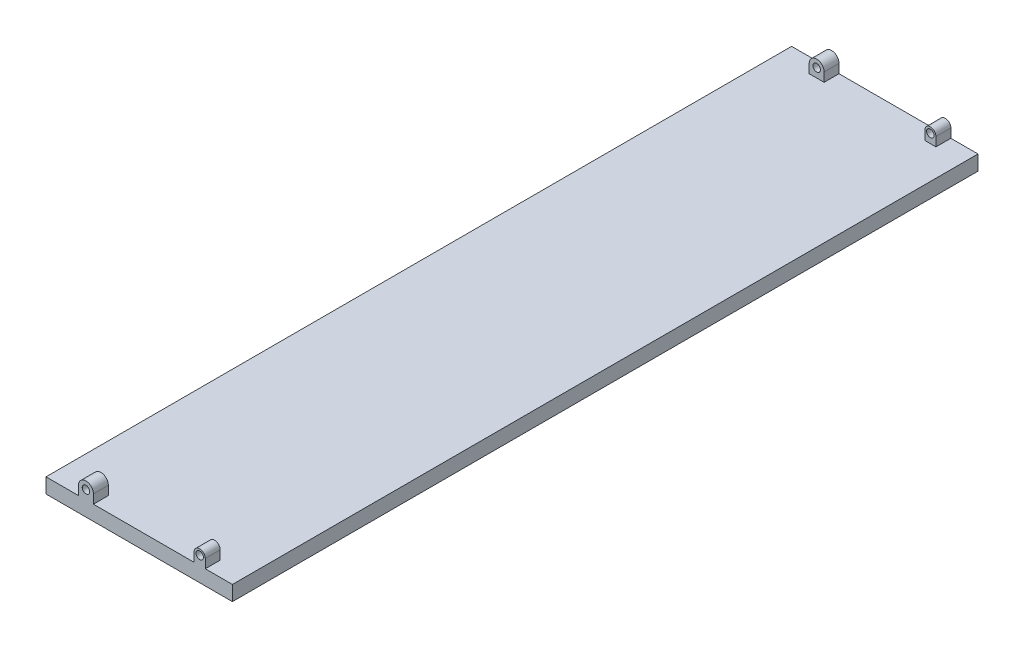
ISO-10303-21;
HEADER;
FILE_DESCRIPTION(('STEP AP214'),'2;1');
FILE_NAME('part.step','',(''),(''),'','','');
FILE_SCHEMA(('AUTOMOTIVE_DESIGN { 1 0 10303 214 1 1 1 1 }'));
ENDSEC;
DATA;
#1=APPLICATION_CONTEXT('core data for automotive mechanical design processes');
#2=APPLICATION_PROTOCOL_DEFINITION('international standard','automotive_design',2000,#1);
#3=PRODUCT_CONTEXT('',#1,'mechanical');
#4=PRODUCT('Part','Part','',(#3));
#5=PRODUCT_RELATED_PRODUCT_CATEGORY('part','',(#4));
#6=PRODUCT_DEFINITION_FORMATION('','',#4);
#7=PRODUCT_DEFINITION_CONTEXT('part definition',#1,'design');
#8=PRODUCT_DEFINITION('design','',#6,#7);
#9=PRODUCT_DEFINITION_SHAPE('','',#8);
#10=(LENGTH_UNIT() NAMED_UNIT(*) SI_UNIT(.MILLI.,.METRE.));
#11=(NAMED_UNIT(*) PLANE_ANGLE_UNIT() SI_UNIT($,.RADIAN.));
#12=(NAMED_UNIT(*) SI_UNIT($,.STERADIAN.) SOLID_ANGLE_UNIT());
#13=UNCERTAINTY_MEASURE_WITH_UNIT(LENGTH_MEASURE(1.E-05),#10,'distance_accuracy_value','');
#14=(GEOMETRIC_REPRESENTATION_CONTEXT(3) GLOBAL_UNCERTAINTY_ASSIGNED_CONTEXT((#13)) GLOBAL_UNIT_ASSIGNED_CONTEXT((#10,
#11,#12)) REPRESENTATION_CONTEXT('',''));
#15=CARTESIAN_POINT('',(0.,0.,0.));
#16=DIRECTION('',(0.,0.,1.));
#17=DIRECTION('',(1.,0.,0.));
#18=AXIS2_PLACEMENT_3D('',#15,#16,#17);
#19=CARTESIAN_POINT('',(-125.,10.,-1000.));
#20=DIRECTION('',(0.,1.,0.));
#21=DIRECTION('',(0.,0.,1.));
#22=AXIS2_PLACEMENT_3D('',#19,#20,#21);
#23=PLANE('',#22);
#24=DIRECTION('',(-1.,0.,0.));
#25=VECTOR('',#24,1.);
#26=CARTESIAN_POINT('',(-125.,10.,-1000.));
#27=LINE('',#26,#25);
#28=CARTESIAN_POINT('',(73.5999999999999,10.,-1000.));
#29=VERTEX_POINT('',#28);
#30=CARTESIAN_POINT('',(-61.4000000000001,10.,-1000.));
#31=VERTEX_POINT('',#30);
#32=EDGE_CURVE('E318',#29,#31,#27,.T.);
#33=ORIENTED_EDGE('',*,*,#32,.T.);
#34=DIRECTION('',(0.,0.,-1.));
#35=VECTOR('',#34,1.);
#36=CARTESIAN_POINT('',(-61.4000000000001,10.,-980.));
#37=LINE('',#36,#35);
#38=CARTESIAN_POINT('',(-61.4000000000001,10.,-980.));
#39=VERTEX_POINT('',#38);
#40=EDGE_CURVE('E50',#39,#31,#37,.T.);
#41=ORIENTED_EDGE('',*,*,#40,.F.);
#42=DIRECTION('',(1.,0.,0.));
#43=VECTOR('',#42,1.);
#44=CARTESIAN_POINT('',(-61.4000000000001,10.,-980.));
#45=LINE('',#44,#43);
#46=CARTESIAN_POINT('',(-81.4000000000001,10.,-980.));
#47=VERTEX_POINT('',#46);
#48=EDGE_CURVE('E55',#47,#39,#45,.T.);
#49=ORIENTED_EDGE('',*,*,#48,.F.);
#50=DIRECTION('',(0.,0.,-1.));
#51=VECTOR('',#50,1.);
#52=CARTESIAN_POINT('',(-81.4000000000001,10.,-980.));
#53=LINE('',#52,#51);
#54=CARTESIAN_POINT('',(-81.4000000000001,10.,-1000.));
#55=VERTEX_POINT('',#54);
#56=EDGE_CURVE('E190',#47,#55,#53,.T.);
#57=ORIENTED_EDGE('',*,*,#56,.T.);
#58=CARTESIAN_POINT('',(-125.,10.,-1000.));
#59=VERTEX_POINT('',#58);
#60=EDGE_CURVE('E313',#55,#59,#27,.T.);
#61=ORIENTED_EDGE('',*,*,#60,.T.);
#62=DIRECTION('',(0.,0.,1.));
#63=VECTOR('',#62,1.);
#64=CARTESIAN_POINT('',(-125.,10.,-1000.));
#65=LINE('',#64,#63);
#66=CARTESIAN_POINT('',(-125.,10.,0.));
#67=VERTEX_POINT('',#66);
#68=EDGE_CURVE('E338',#59,#67,#65,.T.);
#69=ORIENTED_EDGE('',*,*,#68,.T.);
#70=DIRECTION('',(-1.,0.,0.));
#71=VECTOR('',#70,1.);
#72=CARTESIAN_POINT('',(-125.,10.,0.));
#73=LINE('',#72,#71);
#74=CARTESIAN_POINT('',(-81.4000000000001,10.,0.));
#75=VERTEX_POINT('',#74);
#76=EDGE_CURVE('E327',#75,#67,#73,.T.);
#77=ORIENTED_EDGE('',*,*,#76,.F.);
#78=DIRECTION('',(0.,0.,1.));
#79=VECTOR('',#78,1.);
#80=CARTESIAN_POINT('',(-81.4000000000001,10.,-20.));
#81=LINE('',#80,#79);
#82=CARTESIAN_POINT('',(-81.4000000000001,10.,-20.));
#83=VERTEX_POINT('',#82);
#84=EDGE_CURVE('E270',#83,#75,#81,.T.);
#85=ORIENTED_EDGE('',*,*,#84,.F.);
#86=DIRECTION('',(1.,0.,0.));
#87=VECTOR('',#86,1.);
#88=CARTESIAN_POINT('',(-61.4000000000001,10.,-20.));
#89=LINE('',#88,#87);
#90=CARTESIAN_POINT('',(-61.4000000000001,10.,-20.));
#91=VERTEX_POINT('',#90);
#92=EDGE_CURVE('E249',#83,#91,#89,.T.);
#93=ORIENTED_EDGE('',*,*,#92,.T.);
#94=DIRECTION('',(0.,0.,1.));
#95=VECTOR('',#94,1.);
#96=CARTESIAN_POINT('',(-61.4000000000001,10.,-20.));
#97=LINE('',#96,#95);
#98=CARTESIAN_POINT('',(-61.4000000000001,10.,0.));
#99=VERTEX_POINT('',#98);
#100=EDGE_CURVE('E262',#91,#99,#97,.T.);
#101=ORIENTED_EDGE('',*,*,#100,.T.);
#102=CARTESIAN_POINT('',(73.5999999999999,10.,0.));
#103=VERTEX_POINT('',#102);
#104=EDGE_CURVE('E332',#103,#99,#73,.T.);
#105=ORIENTED_EDGE('',*,*,#104,.F.);
#106=DIRECTION('',(0.,0.,1.));
#107=VECTOR('',#106,1.);
#108=CARTESIAN_POINT('',(73.5999999999999,10.,-20.));
#109=LINE('',#108,#107);
#110=CARTESIAN_POINT('',(73.5999999999999,10.,-20.));
#111=VERTEX_POINT('',#110);
#112=EDGE_CURVE('E301',#111,#103,#109,.T.);
#113=ORIENTED_EDGE('',*,*,#112,.F.);
#114=DIRECTION('',(1.,0.,0.));
#115=VECTOR('',#114,1.);
#116=CARTESIAN_POINT('',(73.5999999999999,10.,-20.));
#117=LINE('',#116,#115);
#118=CARTESIAN_POINT('',(88.5999999999999,10.,-20.));
#119=VERTEX_POINT('',#118);
#120=EDGE_CURVE('E280',#111,#119,#117,.T.);
#121=ORIENTED_EDGE('',*,*,#120,.T.);
#122=DIRECTION('',(0.,0.,1.));
#123=VECTOR('',#122,1.);
#124=CARTESIAN_POINT('',(88.5999999999999,10.,-20.));
#125=LINE('',#124,#123);
#126=CARTESIAN_POINT('',(88.5999999999999,10.,0.));
#127=VERTEX_POINT('',#126);
#128=EDGE_CURVE('E293',#119,#127,#125,.T.);
#129=ORIENTED_EDGE('',*,*,#128,.T.);
#130=CARTESIAN_POINT('',(125.,10.,0.));
#131=VERTEX_POINT('',#130);
#132=EDGE_CURVE('E328',#131,#127,#73,.T.);
#133=ORIENTED_EDGE('',*,*,#132,.F.);
#134=DIRECTION('',(0.,0.,1.));
#135=VECTOR('',#134,1.);
#136=CARTESIAN_POINT('',(125.,10.,-1000.));
#137=LINE('',#136,#135);
#138=CARTESIAN_POINT('',(125.,10.,-1000.));
#139=VERTEX_POINT('',#138);
#140=EDGE_CURVE('E324',#139,#131,#137,.T.);
#141=ORIENTED_EDGE('',*,*,#140,.F.);
#142=CARTESIAN_POINT('',(88.5999999999999,10.,-1000.));
#143=VERTEX_POINT('',#142);
#144=EDGE_CURVE('E315',#139,#143,#27,.T.);
#145=ORIENTED_EDGE('',*,*,#144,.T.);
#146=DIRECTION('',(0.,0.,-1.));
#147=VECTOR('',#146,1.);
#148=CARTESIAN_POINT('',(88.5999999999999,10.,-980.));
#149=LINE('',#148,#147);
#150=CARTESIAN_POINT('',(88.5999999999999,10.,-980.));
#151=VERTEX_POINT('',#150);
#152=EDGE_CURVE('E224',#151,#143,#149,.T.);
#153=ORIENTED_EDGE('',*,*,#152,.F.);
#154=DIRECTION('',(1.,0.,0.));
#155=VECTOR('',#154,1.);
#156=CARTESIAN_POINT('',(73.5999999999999,10.,-980.));
#157=LINE('',#156,#155);
#158=CARTESIAN_POINT('',(73.5999999999999,10.,-980.));
#159=VERTEX_POINT('',#158);
#160=EDGE_CURVE('E207',#159,#151,#157,.T.);
#161=ORIENTED_EDGE('',*,*,#160,.F.);
#162=DIRECTION('',(0.,0.,-1.));
#163=VECTOR('',#162,1.);
#164=CARTESIAN_POINT('',(73.5999999999999,10.,-980.));
#165=LINE('',#164,#163);
#166=EDGE_CURVE('E218',#159,#29,#165,.T.);
#167=ORIENTED_EDGE('',*,*,#166,.T.);
#168=EDGE_LOOP('',(#33,#41,#49,#57,#61,#69,#77,#85,#93,#101,#105,#113,#121,#129,#133,#141,#145,
#153,#161,#167));
#169=FACE_BOUND('',#168,.T.);
#170=ADVANCED_FACE('F33',(#169),#23,.T.);
#171=CARTESIAN_POINT('',(125.,-10.,-1000.));
#172=DIRECTION('',(1.,0.,0.));
#173=DIRECTION('',(0.,0.,-1.));
#174=AXIS2_PLACEMENT_3D('',#171,#172,#173);
#175=PLANE('',#174);
#176=DIRECTION('',(0.,1.,0.));
#177=VECTOR('',#176,1.);
#178=CARTESIAN_POINT('',(125.,-10.,0.));
#179=LINE('',#178,#177);
#180=CARTESIAN_POINT('',(125.,-10.,0.));
#181=VERTEX_POINT('',#180);
#182=EDGE_CURVE('E303',#181,#131,#179,.T.);
#183=ORIENTED_EDGE('',*,*,#182,.F.);
#184=DIRECTION('',(0.,0.,1.));
#185=VECTOR('',#184,1.);
#186=CARTESIAN_POINT('',(125.,-10.,-1000.));
#187=LINE('',#186,#185);
#188=CARTESIAN_POINT('',(125.,-10.,-1000.));
#189=VERTEX_POINT('',#188);
#190=EDGE_CURVE('E11',#189,#181,#187,.T.);
#191=ORIENTED_EDGE('',*,*,#190,.F.);
#192=DIRECTION('',(0.,1.,0.));
#193=VECTOR('',#192,1.);
#194=CARTESIAN_POINT('',(125.,-10.,-1000.));
#195=LINE('',#194,#193);
#196=EDGE_CURVE('E310',#189,#139,#195,.T.);
#197=ORIENTED_EDGE('',*,*,#196,.T.);
#198=ORIENTED_EDGE('',*,*,#140,.T.);
#199=EDGE_LOOP('',(#183,#191,#197,#198));
#200=FACE_BOUND('',#199,.T.);
#201=ADVANCED_FACE('F35',(#200),#175,.T.);
#202=CARTESIAN_POINT('',(-125.,-10.,-1000.));
#203=DIRECTION('',(0.,-1.,0.));
#204=DIRECTION('',(0.,0.,-1.));
#205=AXIS2_PLACEMENT_3D('',#202,#203,#204);
#206=PLANE('',#205);
#207=DIRECTION('',(1.,0.,0.));
#208=VECTOR('',#207,1.);
#209=CARTESIAN_POINT('',(-125.,-10.,0.));
#210=LINE('',#209,#208);
#211=CARTESIAN_POINT('',(-125.,-10.,0.));
#212=VERTEX_POINT('',#211);
#213=EDGE_CURVE('E314',#212,#181,#210,.T.);
#214=ORIENTED_EDGE('',*,*,#213,.F.);
#215=DIRECTION('',(0.,0.,1.));
#216=VECTOR('',#215,1.);
#217=CARTESIAN_POINT('',(-125.,-10.,-1000.));
#218=LINE('',#217,#216);
#219=CARTESIAN_POINT('',(-125.,-10.,-1000.));
#220=VERTEX_POINT('',#219);
#221=EDGE_CURVE('E42',#220,#212,#218,.T.);
#222=ORIENTED_EDGE('',*,*,#221,.F.);
#223=DIRECTION('',(1.,0.,0.));
#224=VECTOR('',#223,1.);
#225=CARTESIAN_POINT('',(-125.,-10.,-1000.));
#226=LINE('',#225,#224);
#227=EDGE_CURVE('E321',#220,#189,#226,.T.);
#228=ORIENTED_EDGE('',*,*,#227,.T.);
#229=ORIENTED_EDGE('',*,*,#190,.T.);
#230=EDGE_LOOP('',(#214,#222,#228,#229));
#231=FACE_BOUND('',#230,.T.);
#232=ADVANCED_FACE('F388',(#231),#206,.T.);
#233=CARTESIAN_POINT('',(-125.,-10.,-1000.));
#234=DIRECTION('',(-1.,0.,0.));
#235=DIRECTION('',(0.,0.,1.));
#236=AXIS2_PLACEMENT_3D('',#233,#234,#235);
#237=PLANE('',#236);
#238=DIRECTION('',(0.,-1.,0.));
#239=VECTOR('',#238,1.);
#240=CARTESIAN_POINT('',(-125.,-10.,0.));
#241=LINE('',#240,#239);
#242=EDGE_CURVE('E331',#67,#212,#241,.T.);
#243=ORIENTED_EDGE('',*,*,#242,.F.);
#244=ORIENTED_EDGE('',*,*,#68,.F.);
#245=DIRECTION('',(0.,-1.,0.));
#246=VECTOR('',#245,1.);
#247=CARTESIAN_POINT('',(-125.,-10.,-1000.));
#248=LINE('',#247,#246);
#249=EDGE_CURVE('E317',#59,#220,#248,.T.);
#250=ORIENTED_EDGE('',*,*,#249,.T.);
#251=ORIENTED_EDGE('',*,*,#221,.T.);
#252=EDGE_LOOP('',(#243,#244,#250,#251));
#253=FACE_BOUND('',#252,.T.);
#254=ADVANCED_FACE('F391',(#253),#237,.T.);
#255=CARTESIAN_POINT('',(0.,0.,-1000.));
#256=DIRECTION('',(0.,0.,-1.));
#257=DIRECTION('',(-1.,0.,0.));
#258=AXIS2_PLACEMENT_3D('',#255,#256,#257);
#259=PLANE('',#258);
#260=CARTESIAN_POINT('',(-71.4000000000001,22.,-1000.));
#261=DIRECTION('',(0.,0.,-1.));
#262=DIRECTION('',(-1.,0.,0.));
#263=AXIS2_PLACEMENT_3D('',#260,#261,#262);
#264=CIRCLE('',#263,5.025);
#265=CARTESIAN_POINT('',(-76.4250000000001,22.,-1000.));
#266=VERTEX_POINT('',#265);
#267=EDGE_CURVE('E600',#266,#266,#264,.T.);
#268=ORIENTED_EDGE('',*,*,#267,.F.);
#269=EDGE_LOOP('',(#268));
#270=FACE_BOUND('',#269,.T.);
#271=CARTESIAN_POINT('',(81.0999999999999,22.,-1000.));
#272=DIRECTION('',(0.,0.,-1.));
#273=DIRECTION('',(-1.,0.,0.));
#274=AXIS2_PLACEMENT_3D('',#271,#272,#273);
#275=CIRCLE('',#274,5.025);
#276=CARTESIAN_POINT('',(76.0749999999999,22.,-1000.));
#277=VERTEX_POINT('',#276);
#278=EDGE_CURVE('E607',#277,#277,#275,.T.);
#279=ORIENTED_EDGE('',*,*,#278,.F.);
#280=EDGE_LOOP('',(#279));
#281=FACE_BOUND('',#280,.T.);
#282=ORIENTED_EDGE('',*,*,#196,.F.);
#283=ORIENTED_EDGE('',*,*,#227,.F.);
#284=ORIENTED_EDGE('',*,*,#249,.F.);
#285=ORIENTED_EDGE('',*,*,#60,.F.);
#286=DIRECTION('',(0.,-1.,0.));
#287=VECTOR('',#286,1.);
#288=CARTESIAN_POINT('',(-81.4000000000001,10.,-1000.));
#289=LINE('',#288,#287);
#290=CARTESIAN_POINT('',(-81.4000000000001,22.,-1000.));
#291=VERTEX_POINT('',#290);
#292=EDGE_CURVE('E199',#291,#55,#289,.T.);
#293=ORIENTED_EDGE('',*,*,#292,.F.);
#294=CARTESIAN_POINT('',(-71.4000000000001,22.,-1000.));
#295=DIRECTION('',(0.,0.,1.));
#296=DIRECTION('',(-1.,0.,0.));
#297=AXIS2_PLACEMENT_3D('',#294,#295,#296);
#298=CIRCLE('',#297,10.);
#299=CARTESIAN_POINT('',(-61.4000000000001,22.,-1000.));
#300=VERTEX_POINT('',#299);
#301=EDGE_CURVE('E185',#300,#291,#298,.T.);
#302=ORIENTED_EDGE('',*,*,#301,.F.);
#303=DIRECTION('',(0.,1.,0.));
#304=VECTOR('',#303,1.);
#305=CARTESIAN_POINT('',(-61.4000000000001,22.,-1000.));
#306=LINE('',#305,#304);
#307=EDGE_CURVE('E194',#31,#300,#306,.T.);
#308=ORIENTED_EDGE('',*,*,#307,.F.);
#309=ORIENTED_EDGE('',*,*,#32,.F.);
#310=DIRECTION('',(0.,-1.,0.));
#311=VECTOR('',#310,1.);
#312=CARTESIAN_POINT('',(73.5999999999999,22.,-1000.));
#313=LINE('',#312,#311);
#314=CARTESIAN_POINT('',(73.5999999999999,22.,-1000.));
#315=VERTEX_POINT('',#314);
#316=EDGE_CURVE('E204',#315,#29,#313,.T.);
#317=ORIENTED_EDGE('',*,*,#316,.F.);
#318=CARTESIAN_POINT('',(81.0999999999999,22.,-1000.));
#319=DIRECTION('',(0.,0.,1.));
#320=DIRECTION('',(1.,0.,0.));
#321=AXIS2_PLACEMENT_3D('',#318,#319,#320);
#322=CIRCLE('',#321,7.5);
#323=CARTESIAN_POINT('',(88.5999999999999,22.,-1000.));
#324=VERTEX_POINT('',#323);
#325=EDGE_CURVE('E221',#324,#315,#322,.T.);
#326=ORIENTED_EDGE('',*,*,#325,.F.);
#327=DIRECTION('',(0.,1.,0.));
#328=VECTOR('',#327,1.);
#329=CARTESIAN_POINT('',(88.5999999999999,10.,-1000.));
#330=LINE('',#329,#328);
#331=EDGE_CURVE('E211',#143,#324,#330,.T.);
#332=ORIENTED_EDGE('',*,*,#331,.F.);
#333=ORIENTED_EDGE('',*,*,#144,.F.);
#334=EDGE_LOOP('',(#282,#283,#284,#285,#293,#302,#308,#309,#317,#326,#332,#333));
#335=FACE_BOUND('',#334,.T.);
#336=ADVANCED_FACE('F394',(#270,#281,#335),#259,.T.);
#337=CARTESIAN_POINT('',(0.,0.,0.));
#338=DIRECTION('',(0.,0.,-1.));
#339=DIRECTION('',(-1.,0.,0.));
#340=AXIS2_PLACEMENT_3D('',#337,#338,#339);
#341=PLANE('',#340);
#342=CARTESIAN_POINT('',(-71.4000000000001,22.,0.));
#343=DIRECTION('',(0.,0.,1.));
#344=DIRECTION('',(1.,0.,0.));
#345=AXIS2_PLACEMENT_3D('',#342,#343,#344);
#346=CIRCLE('',#345,5.025);
#347=CARTESIAN_POINT('',(-66.3750000000001,22.,0.));
#348=VERTEX_POINT('',#347);
#349=EDGE_CURVE('E227',#348,#348,#346,.T.);
#350=ORIENTED_EDGE('',*,*,#349,.F.);
#351=EDGE_LOOP('',(#350));
#352=FACE_BOUND('',#351,.T.);
#353=CARTESIAN_POINT('',(81.0999999999999,22.,0.));
#354=DIRECTION('',(0.,0.,1.));
#355=DIRECTION('',(1.,0.,0.));
#356=AXIS2_PLACEMENT_3D('',#353,#354,#355);
#357=CIRCLE('',#356,5.025);
#358=CARTESIAN_POINT('',(86.1249999999999,22.,0.));
#359=VERTEX_POINT('',#358);
#360=EDGE_CURVE('E242',#359,#359,#357,.T.);
#361=ORIENTED_EDGE('',*,*,#360,.F.);
#362=EDGE_LOOP('',(#361));
#363=FACE_BOUND('',#362,.T.);
#364=ORIENTED_EDGE('',*,*,#182,.T.);
#365=ORIENTED_EDGE('',*,*,#132,.T.);
#366=DIRECTION('',(0.,1.,0.));
#367=VECTOR('',#366,1.);
#368=CARTESIAN_POINT('',(88.5999999999999,10.,0.));
#369=LINE('',#368,#367);
#370=CARTESIAN_POINT('',(88.5999999999999,22.,0.));
#371=VERTEX_POINT('',#370);
#372=EDGE_CURVE('E273',#127,#371,#369,.T.);
#373=ORIENTED_EDGE('',*,*,#372,.T.);
#374=CARTESIAN_POINT('',(81.0999999999999,22.,0.));
#375=DIRECTION('',(0.,0.,1.));
#376=DIRECTION('',(1.,0.,0.));
#377=AXIS2_PLACEMENT_3D('',#374,#375,#376);
#378=CIRCLE('',#377,7.5);
#379=CARTESIAN_POINT('',(73.5999999999999,22.,0.));
#380=VERTEX_POINT('',#379);
#381=EDGE_CURVE('E296',#371,#380,#378,.T.);
#382=ORIENTED_EDGE('',*,*,#381,.T.);
#383=DIRECTION('',(0.,-1.,0.));
#384=VECTOR('',#383,1.);
#385=CARTESIAN_POINT('',(73.5999999999999,22.,0.));
#386=LINE('',#385,#384);
#387=EDGE_CURVE('E284',#380,#103,#386,.T.);
#388=ORIENTED_EDGE('',*,*,#387,.T.);
#389=ORIENTED_EDGE('',*,*,#104,.T.);
#390=DIRECTION('',(0.,1.,0.));
#391=VECTOR('',#390,1.);
#392=CARTESIAN_POINT('',(-61.4000000000001,22.,0.));
#393=LINE('',#392,#391);
#394=CARTESIAN_POINT('',(-61.4000000000001,22.,0.));
#395=VERTEX_POINT('',#394);
#396=EDGE_CURVE('E263',#99,#395,#393,.T.);
#397=ORIENTED_EDGE('',*,*,#396,.T.);
#398=CARTESIAN_POINT('',(-71.4000000000001,22.,0.));
#399=DIRECTION('',(0.,0.,1.));
#400=DIRECTION('',(-1.,0.,0.));
#401=AXIS2_PLACEMENT_3D('',#398,#399,#400);
#402=CIRCLE('',#401,10.);
#403=CARTESIAN_POINT('',(-81.4000000000001,22.,0.));
#404=VERTEX_POINT('',#403);
#405=EDGE_CURVE('E266',#395,#404,#402,.T.);
#406=ORIENTED_EDGE('',*,*,#405,.T.);
#407=DIRECTION('',(0.,-1.,0.));
#408=VECTOR('',#407,1.);
#409=CARTESIAN_POINT('',(-81.4000000000001,10.,0.));
#410=LINE('',#409,#408);
#411=EDGE_CURVE('E253',#404,#75,#410,.T.);
#412=ORIENTED_EDGE('',*,*,#411,.T.);
#413=ORIENTED_EDGE('',*,*,#76,.T.);
#414=ORIENTED_EDGE('',*,*,#242,.T.);
#415=ORIENTED_EDGE('',*,*,#213,.T.);
#416=EDGE_LOOP('',(#364,#365,#373,#382,#388,#389,#397,#406,#412,#413,#414,#415));
#417=FACE_BOUND('',#416,.T.);
#418=ADVANCED_FACE('F368',(#352,#363,#417),#341,.F.);
#419=CARTESIAN_POINT('',(73.5999999999999,22.,-20.));
#420=DIRECTION('',(-1.,0.,0.));
#421=DIRECTION('',(0.,0.,1.));
#422=AXIS2_PLACEMENT_3D('',#419,#420,#421);
#423=PLANE('',#422);
#424=ORIENTED_EDGE('',*,*,#387,.F.);
#425=DIRECTION('',(0.,0.,1.));
#426=VECTOR('',#425,1.);
#427=CARTESIAN_POINT('',(73.5999999999999,22.,-20.));
#428=LINE('',#427,#426);
#429=CARTESIAN_POINT('',(73.5999999999999,22.,-20.));
#430=VERTEX_POINT('',#429);
#431=EDGE_CURVE('E304',#430,#380,#428,.T.);
#432=ORIENTED_EDGE('',*,*,#431,.F.);
#433=DIRECTION('',(0.,-1.,0.));
#434=VECTOR('',#433,1.);
#435=CARTESIAN_POINT('',(73.5999999999999,22.,-20.));
#436=LINE('',#435,#434);
#437=EDGE_CURVE('E290',#430,#111,#436,.T.);
#438=ORIENTED_EDGE('',*,*,#437,.T.);
#439=ORIENTED_EDGE('',*,*,#112,.T.);
#440=EDGE_LOOP('',(#424,#432,#438,#439));
#441=FACE_BOUND('',#440,.T.);
#442=ADVANCED_FACE('F401',(#441),#423,.T.);
#443=CARTESIAN_POINT('',(81.0999999999999,22.,-20.));
#444=DIRECTION('',(0.,0.,1.));
#445=DIRECTION('',(1.,0.,0.));
#446=AXIS2_PLACEMENT_3D('',#443,#444,#445);
#447=CYLINDRICAL_SURFACE('',#446,7.5);
#448=ORIENTED_EDGE('',*,*,#381,.F.);
#449=DIRECTION('',(0.,0.,1.));
#450=VECTOR('',#449,1.);
#451=CARTESIAN_POINT('',(88.5999999999999,22.,-20.));
#452=LINE('',#451,#450);
#453=CARTESIAN_POINT('',(88.5999999999999,22.,-20.));
#454=VERTEX_POINT('',#453);
#455=EDGE_CURVE('E306',#454,#371,#452,.T.);
#456=ORIENTED_EDGE('',*,*,#455,.F.);
#457=CARTESIAN_POINT('',(81.0999999999999,22.,-20.));
#458=DIRECTION('',(0.,0.,1.));
#459=DIRECTION('',(1.,0.,0.));
#460=AXIS2_PLACEMENT_3D('',#457,#458,#459);
#461=CIRCLE('',#460,7.5);
#462=EDGE_CURVE('E287',#454,#430,#461,.T.);
#463=ORIENTED_EDGE('',*,*,#462,.T.);
#464=ORIENTED_EDGE('',*,*,#431,.T.);
#465=EDGE_LOOP('',(#448,#456,#463,#464));
#466=FACE_BOUND('',#465,.T.);
#467=ADVANCED_FACE('F409',(#466),#447,.T.);
#468=CARTESIAN_POINT('',(88.5999999999999,10.,-20.));
#469=DIRECTION('',(1.,0.,0.));
#470=DIRECTION('',(0.,0.,-1.));
#471=AXIS2_PLACEMENT_3D('',#468,#469,#470);
#472=PLANE('',#471);
#473=ORIENTED_EDGE('',*,*,#372,.F.);
#474=ORIENTED_EDGE('',*,*,#128,.F.);
#475=DIRECTION('',(0.,1.,0.));
#476=VECTOR('',#475,1.);
#477=CARTESIAN_POINT('',(88.5999999999999,10.,-20.));
#478=LINE('',#477,#476);
#479=EDGE_CURVE('E283',#119,#454,#478,.T.);
#480=ORIENTED_EDGE('',*,*,#479,.T.);
#481=ORIENTED_EDGE('',*,*,#455,.T.);
#482=EDGE_LOOP('',(#473,#474,#480,#481));
#483=FACE_BOUND('',#482,.T.);
#484=ADVANCED_FACE('F406',(#483),#472,.T.);
#485=CARTESIAN_POINT('',(81.0999999999999,22.,-20.));
#486=DIRECTION('',(0.,0.,1.));
#487=DIRECTION('',(1.,0.,0.));
#488=AXIS2_PLACEMENT_3D('',#485,#486,#487);
#489=PLANE('',#488);
#490=CARTESIAN_POINT('',(81.0999999999999,22.,-20.));
#491=DIRECTION('',(0.,0.,1.));
#492=DIRECTION('',(1.,0.,0.));
#493=AXIS2_PLACEMENT_3D('',#490,#491,#492);
#494=CIRCLE('',#493,4.99999999999987);
#495=CARTESIAN_POINT('',(86.0999999999998,22.,-20.));
#496=VERTEX_POINT('',#495);
#497=EDGE_CURVE('E248',#496,#496,#494,.T.);
#498=ORIENTED_EDGE('',*,*,#497,.T.);
#499=EDGE_LOOP('',(#498));
#500=FACE_BOUND('',#499,.T.);
#501=ORIENTED_EDGE('',*,*,#120,.F.);
#502=ORIENTED_EDGE('',*,*,#437,.F.);
#503=ORIENTED_EDGE('',*,*,#462,.F.);
#504=ORIENTED_EDGE('',*,*,#479,.F.);
#505=EDGE_LOOP('',(#501,#502,#503,#504));
#506=FACE_BOUND('',#505,.T.);
#507=ADVANCED_FACE('F382',(#500,#506),#489,.F.);
#508=CARTESIAN_POINT('',(-81.4000000000001,10.,-20.));
#509=DIRECTION('',(-1.,0.,0.));
#510=DIRECTION('',(0.,0.,1.));
#511=AXIS2_PLACEMENT_3D('',#508,#509,#510);
#512=PLANE('',#511);
#513=ORIENTED_EDGE('',*,*,#411,.F.);
#514=DIRECTION('',(0.,0.,1.));
#515=VECTOR('',#514,1.);
#516=CARTESIAN_POINT('',(-81.4000000000001,22.,-20.));
#517=LINE('',#516,#515);
#518=CARTESIAN_POINT('',(-81.4000000000001,22.,-20.));
#519=VERTEX_POINT('',#518);
#520=EDGE_CURVE('E274',#519,#404,#517,.T.);
#521=ORIENTED_EDGE('',*,*,#520,.F.);
#522=DIRECTION('',(0.,-1.,0.));
#523=VECTOR('',#522,1.);
#524=CARTESIAN_POINT('',(-81.4000000000001,10.,-20.));
#525=LINE('',#524,#523);
#526=EDGE_CURVE('E259',#519,#83,#525,.T.);
#527=ORIENTED_EDGE('',*,*,#526,.T.);
#528=ORIENTED_EDGE('',*,*,#84,.T.);
#529=EDGE_LOOP('',(#513,#521,#527,#528));
#530=FACE_BOUND('',#529,.T.);
#531=ADVANCED_FACE('F361',(#530),#512,.T.);
#532=CARTESIAN_POINT('',(-71.4000000000001,22.,-20.));
#533=DIRECTION('',(0.,0.,1.));
#534=DIRECTION('',(1.,0.,0.));
#535=AXIS2_PLACEMENT_3D('',#532,#533,#534);
#536=CYLINDRICAL_SURFACE('',#535,10.);
#537=ORIENTED_EDGE('',*,*,#405,.F.);
#538=DIRECTION('',(0.,0.,1.));
#539=VECTOR('',#538,1.);
#540=CARTESIAN_POINT('',(-61.4000000000001,22.,-20.));
#541=LINE('',#540,#539);
#542=CARTESIAN_POINT('',(-61.4000000000001,22.,-20.));
#543=VERTEX_POINT('',#542);
#544=EDGE_CURVE('E276',#543,#395,#541,.T.);
#545=ORIENTED_EDGE('',*,*,#544,.F.);
#546=CARTESIAN_POINT('',(-71.4000000000001,22.,-20.));
#547=DIRECTION('',(0.,0.,1.));
#548=DIRECTION('',(-1.,0.,0.));
#549=AXIS2_PLACEMENT_3D('',#546,#547,#548);
#550=CIRCLE('',#549,10.);
#551=EDGE_CURVE('E256',#543,#519,#550,.T.);
#552=ORIENTED_EDGE('',*,*,#551,.T.);
#553=ORIENTED_EDGE('',*,*,#520,.T.);
#554=EDGE_LOOP('',(#537,#545,#552,#553));
#555=FACE_BOUND('',#554,.T.);
#556=ADVANCED_FACE('F374',(#555),#536,.T.);
#557=CARTESIAN_POINT('',(-61.4000000000001,22.,-20.));
#558=DIRECTION('',(1.,0.,0.));
#559=DIRECTION('',(0.,1.,0.));
#560=AXIS2_PLACEMENT_3D('',#557,#558,#559);
#561=PLANE('',#560);
#562=ORIENTED_EDGE('',*,*,#396,.F.);
#563=ORIENTED_EDGE('',*,*,#100,.F.);
#564=DIRECTION('',(0.,1.,0.));
#565=VECTOR('',#564,1.);
#566=CARTESIAN_POINT('',(-61.4000000000001,22.,-20.));
#567=LINE('',#566,#565);
#568=EDGE_CURVE('E252',#91,#543,#567,.T.);
#569=ORIENTED_EDGE('',*,*,#568,.T.);
#570=ORIENTED_EDGE('',*,*,#544,.T.);
#571=EDGE_LOOP('',(#562,#563,#569,#570));
#572=FACE_BOUND('',#571,.T.);
#573=ADVANCED_FACE('F353',(#572),#561,.T.);
#574=CARTESIAN_POINT('',(-71.4000000000001,22.,-20.));
#575=DIRECTION('',(0.,0.,-1.));
#576=DIRECTION('',(-1.,0.,0.));
#577=AXIS2_PLACEMENT_3D('',#574,#575,#576);
#578=PLANE('',#577);
#579=CARTESIAN_POINT('',(-71.4000000000001,22.,-20.));
#580=DIRECTION('',(0.,0.,-1.));
#581=DIRECTION('',(-1.,0.,0.));
#582=AXIS2_PLACEMENT_3D('',#579,#580,#581);
#583=CIRCLE('',#582,4.99999999999987);
#584=CARTESIAN_POINT('',(-76.3999999999999,22.,-20.));
#585=VERTEX_POINT('',#584);
#586=EDGE_CURVE('E241',#585,#585,#583,.T.);
#587=ORIENTED_EDGE('',*,*,#586,.F.);
#588=EDGE_LOOP('',(#587));
#589=FACE_BOUND('',#588,.T.);
#590=ORIENTED_EDGE('',*,*,#92,.F.);
#591=ORIENTED_EDGE('',*,*,#526,.F.);
#592=ORIENTED_EDGE('',*,*,#551,.F.);
#593=ORIENTED_EDGE('',*,*,#568,.F.);
#594=EDGE_LOOP('',(#590,#591,#592,#593));
#595=FACE_BOUND('',#594,.T.);
#596=ADVANCED_FACE('F349',(#589,#595),#578,.T.);
#597=CARTESIAN_POINT('',(81.0999999999999,22.,0.));
#598=DIRECTION('',(0.,0.,1.));
#599=DIRECTION('',(1.,0.,0.));
#600=AXIS2_PLACEMENT_3D('',#597,#598,#599);
#601=CYLINDRICAL_SURFACE('',#600,4.99999999999987);
#602=CARTESIAN_POINT('',(81.0999999999999,22.,-0.0249999999999972));
#603=DIRECTION('',(0.,0.,1.));
#604=DIRECTION('',(1.,0.,0.));
#605=AXIS2_PLACEMENT_3D('',#602,#603,#604);
#606=CIRCLE('',#605,4.99999999999999);
#607=CARTESIAN_POINT('',(86.0999999999999,22.,-0.0249999999999972));
#608=VERTEX_POINT('',#607);
#609=EDGE_CURVE('E245',#608,#608,#606,.T.);
#610=ORIENTED_EDGE('',*,*,#609,.T.);
#611=EDGE_LOOP('',(#610));
#612=FACE_BOUND('',#611,.T.);
#613=ORIENTED_EDGE('',*,*,#497,.F.);
#614=EDGE_LOOP('',(#613));
#615=FACE_BOUND('',#614,.T.);
#616=ADVANCED_FACE('F352',(#612,#615),#601,.F.);
#617=CARTESIAN_POINT('',(81.0999999999999,22.,0.));
#618=DIRECTION('',(0.,0.,1.));
#619=DIRECTION('',(1.,0.,0.));
#620=AXIS2_PLACEMENT_3D('',#617,#618,#619);
#621=CONICAL_SURFACE('',#620,5.025,0.785398163397691);
#622=ORIENTED_EDGE('',*,*,#609,.F.);
#623=EDGE_LOOP('',(#622));
#624=FACE_BOUND('',#623,.T.);
#625=ORIENTED_EDGE('',*,*,#360,.T.);
#626=EDGE_LOOP('',(#625));
#627=FACE_BOUND('',#626,.T.);
#628=ADVANCED_FACE('F481',(#624,#627),#621,.F.);
#629=CARTESIAN_POINT('',(-71.4000000000001,22.,0.));
#630=DIRECTION('',(0.,0.,1.));
#631=DIRECTION('',(1.,0.,0.));
#632=AXIS2_PLACEMENT_3D('',#629,#630,#631);
#633=CYLINDRICAL_SURFACE('',#632,4.99999999999987);
#634=ORIENTED_EDGE('',*,*,#586,.T.);
#635=EDGE_LOOP('',(#634));
#636=FACE_BOUND('',#635,.T.);
#637=CARTESIAN_POINT('',(-71.4000000000001,22.,-0.0249999999999972));
#638=DIRECTION('',(0.,0.,1.));
#639=DIRECTION('',(1.,0.,0.));
#640=AXIS2_PLACEMENT_3D('',#637,#638,#639);
#641=CIRCLE('',#640,4.99999999999999);
#642=CARTESIAN_POINT('',(-66.4000000000001,22.,-0.0249999999999972));
#643=VERTEX_POINT('',#642);
#644=EDGE_CURVE('E238',#643,#643,#641,.T.);
#645=ORIENTED_EDGE('',*,*,#644,.T.);
#646=EDGE_LOOP('',(#645));
#647=FACE_BOUND('',#646,.T.);
#648=ADVANCED_FACE('F346',(#636,#647),#633,.F.);
#649=CARTESIAN_POINT('',(-71.4000000000001,22.,0.));
#650=DIRECTION('',(0.,0.,1.));
#651=DIRECTION('',(1.,0.,0.));
#652=AXIS2_PLACEMENT_3D('',#649,#650,#651);
#653=CONICAL_SURFACE('',#652,5.025,0.785398163397691);
#654=ORIENTED_EDGE('',*,*,#644,.F.);
#655=EDGE_LOOP('',(#654));
#656=FACE_BOUND('',#655,.T.);
#657=ORIENTED_EDGE('',*,*,#349,.T.);
#658=EDGE_LOOP('',(#657));
#659=FACE_BOUND('',#658,.T.);
#660=ADVANCED_FACE('F470',(#656,#659),#653,.F.);
#661=CARTESIAN_POINT('',(88.5999999999999,10.,-980.));
#662=DIRECTION('',(-1.,0.,0.));
#663=DIRECTION('',(0.,0.,1.));
#664=AXIS2_PLACEMENT_3D('',#661,#662,#663);
#665=PLANE('',#664);
#666=ORIENTED_EDGE('',*,*,#331,.T.);
#667=DIRECTION('',(0.,0.,-1.));
#668=VECTOR('',#667,1.);
#669=CARTESIAN_POINT('',(88.5999999999999,22.,-980.));
#670=LINE('',#669,#668);
#671=CARTESIAN_POINT('',(88.5999999999999,22.,-980.));
#672=VERTEX_POINT('',#671);
#673=EDGE_CURVE('E228',#672,#324,#670,.T.);
#674=ORIENTED_EDGE('',*,*,#673,.F.);
#675=DIRECTION('',(0.,1.,0.));
#676=VECTOR('',#675,1.);
#677=CARTESIAN_POINT('',(88.5999999999999,10.,-980.));
#678=LINE('',#677,#676);
#679=EDGE_CURVE('E216',#151,#672,#678,.T.);
#680=ORIENTED_EDGE('',*,*,#679,.F.);
#681=ORIENTED_EDGE('',*,*,#152,.T.);
#682=EDGE_LOOP('',(#666,#674,#680,#681));
#683=FACE_BOUND('',#682,.T.);
#684=ADVANCED_FACE('F440',(#683),#665,.F.);
#685=CARTESIAN_POINT('',(81.0999999999999,22.,-980.));
#686=DIRECTION('',(0.,0.,-1.));
#687=DIRECTION('',(-1.,0.,0.));
#688=AXIS2_PLACEMENT_3D('',#685,#686,#687);
#689=CYLINDRICAL_SURFACE('',#688,7.5);
#690=ORIENTED_EDGE('',*,*,#325,.T.);
#691=DIRECTION('',(0.,0.,-1.));
#692=VECTOR('',#691,1.);
#693=CARTESIAN_POINT('',(73.5999999999999,22.,-980.));
#694=LINE('',#693,#692);
#695=CARTESIAN_POINT('',(73.5999999999999,22.,-980.));
#696=VERTEX_POINT('',#695);
#697=EDGE_CURVE('E231',#696,#315,#694,.T.);
#698=ORIENTED_EDGE('',*,*,#697,.F.);
#699=CARTESIAN_POINT('',(81.0999999999999,22.,-980.));
#700=DIRECTION('',(0.,0.,1.));
#701=DIRECTION('',(1.,0.,0.));
#702=AXIS2_PLACEMENT_3D('',#699,#700,#701);
#703=CIRCLE('',#702,7.5);
#704=EDGE_CURVE('E214',#672,#696,#703,.T.);
#705=ORIENTED_EDGE('',*,*,#704,.F.);
#706=ORIENTED_EDGE('',*,*,#673,.T.);
#707=EDGE_LOOP('',(#690,#698,#705,#706));
#708=FACE_BOUND('',#707,.T.);
#709=ADVANCED_FACE('F469',(#708),#689,.T.);
#710=CARTESIAN_POINT('',(73.5999999999999,22.,-980.));
#711=DIRECTION('',(1.,0.,0.));
#712=DIRECTION('',(0.,0.,-1.));
#713=AXIS2_PLACEMENT_3D('',#710,#711,#712);
#714=PLANE('',#713);
#715=ORIENTED_EDGE('',*,*,#316,.T.);
#716=ORIENTED_EDGE('',*,*,#166,.F.);
#717=DIRECTION('',(0.,-1.,0.));
#718=VECTOR('',#717,1.);
#719=CARTESIAN_POINT('',(73.5999999999999,22.,-980.));
#720=LINE('',#719,#718);
#721=EDGE_CURVE('E210',#696,#159,#720,.T.);
#722=ORIENTED_EDGE('',*,*,#721,.F.);
#723=ORIENTED_EDGE('',*,*,#697,.T.);
#724=EDGE_LOOP('',(#715,#716,#722,#723));
#725=FACE_BOUND('',#724,.T.);
#726=ADVANCED_FACE('F448',(#725),#714,.F.);
#727=CARTESIAN_POINT('',(81.0999999999999,22.,-980.));
#728=DIRECTION('',(0.,0.,-1.));
#729=DIRECTION('',(1.,0.,0.));
#730=AXIS2_PLACEMENT_3D('',#727,#728,#729);
#731=PLANE('',#730);
#732=CARTESIAN_POINT('',(81.0999999999999,22.,-980.));
#733=DIRECTION('',(0.,0.,-1.));
#734=DIRECTION('',(-1.,0.,0.));
#735=AXIS2_PLACEMENT_3D('',#732,#733,#734);
#736=CIRCLE('',#735,4.99999999999987);
#737=CARTESIAN_POINT('',(76.1000000000001,22.,-980.));
#738=VERTEX_POINT('',#737);
#739=EDGE_CURVE('E37',#738,#738,#736,.T.);
#740=ORIENTED_EDGE('',*,*,#739,.T.);
#741=EDGE_LOOP('',(#740));
#742=FACE_BOUND('',#741,.T.);
#743=ORIENTED_EDGE('',*,*,#160,.T.);
#744=ORIENTED_EDGE('',*,*,#679,.T.);
#745=ORIENTED_EDGE('',*,*,#704,.T.);
#746=ORIENTED_EDGE('',*,*,#721,.T.);
#747=EDGE_LOOP('',(#743,#744,#745,#746));
#748=FACE_BOUND('',#747,.T.);
#749=ADVANCED_FACE('F444',(#742,#748),#731,.F.);
#750=CARTESIAN_POINT('',(-61.4000000000001,22.,-980.));
#751=DIRECTION('',(-1.,0.,0.));
#752=DIRECTION('',(0.,-1.,0.));
#753=AXIS2_PLACEMENT_3D('',#750,#751,#752);
#754=PLANE('',#753);
#755=ORIENTED_EDGE('',*,*,#307,.T.);
#756=DIRECTION('',(0.,0.,-1.));
#757=VECTOR('',#756,1.);
#758=CARTESIAN_POINT('',(-61.4000000000001,22.,-980.));
#759=LINE('',#758,#757);
#760=CARTESIAN_POINT('',(-61.4000000000001,22.,-980.));
#761=VERTEX_POINT('',#760);
#762=EDGE_CURVE('E189',#761,#300,#759,.T.);
#763=ORIENTED_EDGE('',*,*,#762,.F.);
#764=DIRECTION('',(0.,1.,0.));
#765=VECTOR('',#764,1.);
#766=CARTESIAN_POINT('',(-61.4000000000001,22.,-980.));
#767=LINE('',#766,#765);
#768=EDGE_CURVE('E176',#39,#761,#767,.T.);
#769=ORIENTED_EDGE('',*,*,#768,.F.);
#770=ORIENTED_EDGE('',*,*,#40,.T.);
#771=EDGE_LOOP('',(#755,#763,#769,#770));
#772=FACE_BOUND('',#771,.T.);
#773=ADVANCED_FACE('F452',(#772),#754,.F.);
#774=CARTESIAN_POINT('',(-71.4000000000001,22.,-980.));
#775=DIRECTION('',(0.,0.,-1.));
#776=DIRECTION('',(-1.,0.,0.));
#777=AXIS2_PLACEMENT_3D('',#774,#775,#776);
#778=CYLINDRICAL_SURFACE('',#777,10.);
#779=ORIENTED_EDGE('',*,*,#301,.T.);
#780=DIRECTION('',(0.,0.,-1.));
#781=VECTOR('',#780,1.);
#782=CARTESIAN_POINT('',(-81.4000000000001,22.,-980.));
#783=LINE('',#782,#781);
#784=CARTESIAN_POINT('',(-81.4000000000001,22.,-980.));
#785=VERTEX_POINT('',#784);
#786=EDGE_CURVE('E182',#785,#291,#783,.T.);
#787=ORIENTED_EDGE('',*,*,#786,.F.);
#788=CARTESIAN_POINT('',(-71.4000000000001,22.,-980.));
#789=DIRECTION('',(0.,0.,1.));
#790=DIRECTION('',(-1.,0.,0.));
#791=AXIS2_PLACEMENT_3D('',#788,#789,#790);
#792=CIRCLE('',#791,10.);
#793=EDGE_CURVE('E170',#761,#785,#792,.T.);
#794=ORIENTED_EDGE('',*,*,#793,.F.);
#795=ORIENTED_EDGE('',*,*,#762,.T.);
#796=EDGE_LOOP('',(#779,#787,#794,#795));
#797=FACE_BOUND('',#796,.T.);
#798=ADVANCED_FACE('F183',(#797),#778,.T.);
#799=CARTESIAN_POINT('',(-81.4000000000001,10.,-980.));
#800=DIRECTION('',(1.,0.,0.));
#801=DIRECTION('',(0.,0.,-1.));
#802=AXIS2_PLACEMENT_3D('',#799,#800,#801);
#803=PLANE('',#802);
#804=ORIENTED_EDGE('',*,*,#292,.T.);
#805=ORIENTED_EDGE('',*,*,#56,.F.);
#806=DIRECTION('',(0.,-1.,0.));
#807=VECTOR('',#806,1.);
#808=CARTESIAN_POINT('',(-81.4000000000001,10.,-980.));
#809=LINE('',#808,#807);
#810=EDGE_CURVE('E174',#785,#47,#809,.T.);
#811=ORIENTED_EDGE('',*,*,#810,.F.);
#812=ORIENTED_EDGE('',*,*,#786,.T.);
#813=EDGE_LOOP('',(#804,#805,#811,#812));
#814=FACE_BOUND('',#813,.T.);
#815=ADVANCED_FACE('F192',(#814),#803,.F.);
#816=CARTESIAN_POINT('',(-71.4000000000001,22.,-980.));
#817=DIRECTION('',(0.,0.,1.));
#818=DIRECTION('',(-1.,0.,0.));
#819=AXIS2_PLACEMENT_3D('',#816,#817,#818);
#820=PLANE('',#819);
#821=CARTESIAN_POINT('',(-71.4000000000001,22.,-980.));
#822=DIRECTION('',(0.,0.,1.));
#823=DIRECTION('',(1.,0.,0.));
#824=AXIS2_PLACEMENT_3D('',#821,#822,#823);
#825=CIRCLE('',#824,4.99999999999987);
#826=CARTESIAN_POINT('',(-66.4000000000002,22.,-980.));
#827=VERTEX_POINT('',#826);
#828=EDGE_CURVE('E602',#827,#827,#825,.T.);
#829=ORIENTED_EDGE('',*,*,#828,.F.);
#830=EDGE_LOOP('',(#829));
#831=FACE_BOUND('',#830,.T.);
#832=ORIENTED_EDGE('',*,*,#48,.T.);
#833=ORIENTED_EDGE('',*,*,#768,.T.);
#834=ORIENTED_EDGE('',*,*,#793,.T.);
#835=ORIENTED_EDGE('',*,*,#810,.T.);
#836=EDGE_LOOP('',(#832,#833,#834,#835));
#837=FACE_BOUND('',#836,.T.);
#838=ADVANCED_FACE('F172',(#831,#837),#820,.T.);
#839=CARTESIAN_POINT('',(81.0999999999999,22.,-1000.));
#840=DIRECTION('',(0.,0.,-1.));
#841=DIRECTION('',(-1.,0.,0.));
#842=AXIS2_PLACEMENT_3D('',#839,#840,#841);
#843=CYLINDRICAL_SURFACE('',#842,4.99999999999987);
#844=CARTESIAN_POINT('',(81.0999999999999,22.,-999.975));
#845=DIRECTION('',(0.,0.,-1.));
#846=DIRECTION('',(-1.,0.,0.));
#847=AXIS2_PLACEMENT_3D('',#844,#845,#846);
#848=CIRCLE('',#847,4.99999999999999);
#849=CARTESIAN_POINT('',(76.0999999999999,22.,-999.975));
#850=VERTEX_POINT('',#849);
#851=EDGE_CURVE('E609',#850,#850,#848,.T.);
#852=ORIENTED_EDGE('',*,*,#851,.T.);
#853=EDGE_LOOP('',(#852));
#854=FACE_BOUND('',#853,.T.);
#855=ORIENTED_EDGE('',*,*,#739,.F.);
#856=EDGE_LOOP('',(#855));
#857=FACE_BOUND('',#856,.T.);
#858=ADVANCED_FACE('F552',(#854,#857),#843,.F.);
#859=CARTESIAN_POINT('',(81.0999999999999,22.,-1000.));
#860=DIRECTION('',(0.,0.,-1.));
#861=DIRECTION('',(-1.,0.,0.));
#862=AXIS2_PLACEMENT_3D('',#859,#860,#861);
#863=CONICAL_SURFACE('',#862,5.025,0.785398163398836);
#864=ORIENTED_EDGE('',*,*,#851,.F.);
#865=EDGE_LOOP('',(#864));
#866=FACE_BOUND('',#865,.T.);
#867=ORIENTED_EDGE('',*,*,#278,.T.);
#868=EDGE_LOOP('',(#867));
#869=FACE_BOUND('',#868,.T.);
#870=ADVANCED_FACE('F561',(#866,#869),#863,.F.);
#871=CARTESIAN_POINT('',(-71.4000000000001,22.,-1000.));
#872=DIRECTION('',(0.,0.,-1.));
#873=DIRECTION('',(-1.,0.,0.));
#874=AXIS2_PLACEMENT_3D('',#871,#872,#873);
#875=CYLINDRICAL_SURFACE('',#874,4.99999999999987);
#876=ORIENTED_EDGE('',*,*,#828,.T.);
#877=EDGE_LOOP('',(#876));
#878=FACE_BOUND('',#877,.T.);
#879=CARTESIAN_POINT('',(-71.4000000000001,22.,-999.975));
#880=DIRECTION('',(0.,0.,-1.));
#881=DIRECTION('',(-1.,0.,0.));
#882=AXIS2_PLACEMENT_3D('',#879,#880,#881);
#883=CIRCLE('',#882,4.99999999999999);
#884=CARTESIAN_POINT('',(-76.4000000000001,22.,-999.975));
#885=VERTEX_POINT('',#884);
#886=EDGE_CURVE('E597',#885,#885,#883,.T.);
#887=ORIENTED_EDGE('',*,*,#886,.T.);
#888=EDGE_LOOP('',(#887));
#889=FACE_BOUND('',#888,.T.);
#890=ADVANCED_FACE('F570',(#878,#889),#875,.F.);
#891=CARTESIAN_POINT('',(-71.4000000000001,22.,-1000.));
#892=DIRECTION('',(0.,0.,-1.));
#893=DIRECTION('',(-1.,0.,0.));
#894=AXIS2_PLACEMENT_3D('',#891,#892,#893);
#895=CONICAL_SURFACE('',#894,5.025,0.785398163398836);
#896=ORIENTED_EDGE('',*,*,#886,.F.);
#897=EDGE_LOOP('',(#896));
#898=FACE_BOUND('',#897,.T.);
#899=ORIENTED_EDGE('',*,*,#267,.T.);
#900=EDGE_LOOP('',(#899));
#901=FACE_BOUND('',#900,.T.);
#902=ADVANCED_FACE('F580',(#898,#901),#895,.F.);
#903=CLOSED_SHELL('',(#170,#201,#232,#254,#336,#418,#442,#467,#484,#507,#531,#556,#573,#596,
#616,#628,#648,#660,#684,#709,#726,#749,#773,#798,#815,#838,#858,#870,#890,#902));
#904=MANIFOLD_SOLID_BREP('B2',#903);
#905=ADVANCED_BREP_SHAPE_REPRESENTATION('',(#18,#904),#14);
#906=SHAPE_DEFINITION_REPRESENTATION(#9,#905);
ENDSEC;
END-ISO-10303-21;
